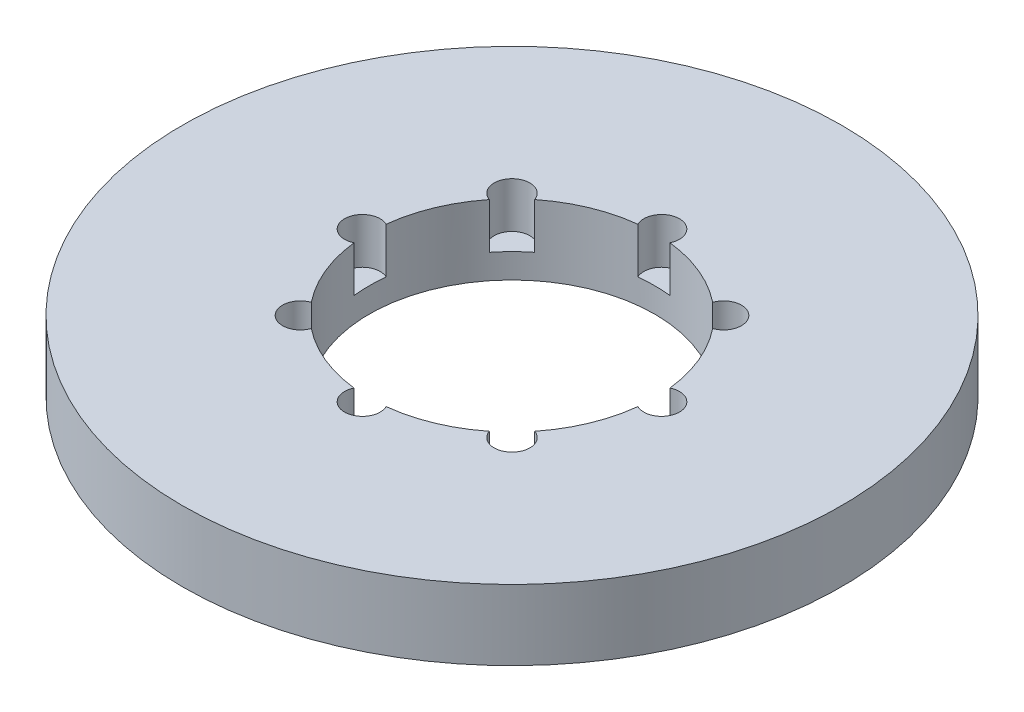
ISO-10303-21;
HEADER;
FILE_DESCRIPTION(('STEP AP214'),'2;1');
FILE_NAME('part.step','',(''),(''),'','','');
FILE_SCHEMA(('AUTOMOTIVE_DESIGN { 1 0 10303 214 1 1 1 1 }'));
ENDSEC;
DATA;
#1=APPLICATION_CONTEXT('core data for automotive mechanical design processes');
#2=APPLICATION_PROTOCOL_DEFINITION('international standard','automotive_design',2000,#1);
#3=PRODUCT_CONTEXT('',#1,'mechanical');
#4=PRODUCT('Part','Part','',(#3));
#5=PRODUCT_RELATED_PRODUCT_CATEGORY('part','',(#4));
#6=PRODUCT_DEFINITION_FORMATION('','',#4);
#7=PRODUCT_DEFINITION_CONTEXT('part definition',#1,'design');
#8=PRODUCT_DEFINITION('design','',#6,#7);
#9=PRODUCT_DEFINITION_SHAPE('','',#8);
#10=(LENGTH_UNIT() NAMED_UNIT(*) SI_UNIT(.MILLI.,.METRE.));
#11=(NAMED_UNIT(*) PLANE_ANGLE_UNIT() SI_UNIT($,.RADIAN.));
#12=(NAMED_UNIT(*) SI_UNIT($,.STERADIAN.) SOLID_ANGLE_UNIT());
#13=UNCERTAINTY_MEASURE_WITH_UNIT(LENGTH_MEASURE(1.E-05),#10,'distance_accuracy_value','');
#14=(GEOMETRIC_REPRESENTATION_CONTEXT(3) GLOBAL_UNCERTAINTY_ASSIGNED_CONTEXT((#13)) GLOBAL_UNIT_ASSIGNED_CONTEXT((#10,
#11,#12)) REPRESENTATION_CONTEXT('',''));
#15=CARTESIAN_POINT('',(0.,0.,0.));
#16=DIRECTION('',(0.,0.,1.));
#17=DIRECTION('',(1.,0.,0.));
#18=AXIS2_PLACEMENT_3D('',#15,#16,#17);
#19=CARTESIAN_POINT('',(0.,16.,0.));
#20=DIRECTION('',(0.,-1.,0.));
#21=DIRECTION('',(0.,0.,-1.));
#22=AXIS2_PLACEMENT_3D('',#19,#20,#21);
#23=CYLINDRICAL_SURFACE('',#22,75.);
#24=CARTESIAN_POINT('',(0.,16.,0.));
#25=DIRECTION('',(0.,1.,0.));
#26=DIRECTION('',(0.,0.,1.));
#27=AXIS2_PLACEMENT_3D('',#24,#25,#26);
#28=CIRCLE('',#27,75.);
#29=CARTESIAN_POINT('',(0.,16.,75.));
#30=VERTEX_POINT('',#29);
#31=EDGE_CURVE('E195',#30,#30,#28,.T.);
#32=ORIENTED_EDGE('',*,*,#31,.F.);
#33=EDGE_LOOP('',(#32));
#34=FACE_BOUND('',#33,.T.);
#35=CARTESIAN_POINT('',(0.,0.,0.));
#36=DIRECTION('',(0.,1.,0.));
#37=DIRECTION('',(0.,0.,1.));
#38=AXIS2_PLACEMENT_3D('',#35,#36,#37);
#39=CIRCLE('',#38,75.);
#40=CARTESIAN_POINT('',(0.,0.,75.));
#41=VERTEX_POINT('',#40);
#42=EDGE_CURVE('E179',#41,#41,#39,.T.);
#43=ORIENTED_EDGE('',*,*,#42,.T.);
#44=EDGE_LOOP('',(#43));
#45=FACE_BOUND('',#44,.T.);
#46=ADVANCED_FACE('F39',(#34,#45),#23,.T.);
#47=CARTESIAN_POINT('',(0.,16.,0.));
#48=DIRECTION('',(0.,1.,0.));
#49=DIRECTION('',(0.,0.,1.));
#50=AXIS2_PLACEMENT_3D('',#47,#48,#49);
#51=PLANE('',#50);
#52=CARTESIAN_POINT('',(1.18898524281873E-13,16.,34.053890811076));
#53=DIRECTION('',(0.,1.,0.));
#54=DIRECTION('',(1.,0.,0.));
#55=AXIS2_PLACEMENT_3D('',#52,#53,#54);
#56=CIRCLE('',#55,4.05931394049338);
#57=CARTESIAN_POINT('',(-3.65774458049449,16.,32.2935118032069));
#58=VERTEX_POINT('',#57);
#59=CARTESIAN_POINT('',(3.65774458049472,16.,32.2935118032069));
#60=VERTEX_POINT('',#59);
#61=EDGE_CURVE('E176',#58,#60,#56,.T.);
#62=ORIENTED_EDGE('',*,*,#61,.F.);
#63=CARTESIAN_POINT('',(0.,16.,0.));
#64=DIRECTION('',(0.,1.,0.));
#65=DIRECTION('',(0.,0.,1.));
#66=AXIS2_PLACEMENT_3D('',#63,#64,#65);
#67=CIRCLE('',#66,32.5);
#68=CARTESIAN_POINT('',(-20.2485451876593,16.,25.4213771810915));
#69=VERTEX_POINT('',#68);
#70=EDGE_CURVE('E166',#69,#58,#67,.T.);
#71=ORIENTED_EDGE('',*,*,#70,.F.);
#72=CARTESIAN_POINT('',(-24.0797371182981,16.,24.0797371182981));
#73=DIRECTION('',(0.,1.,0.));
#74=DIRECTION('',(0.707106781186549,0.,0.707106781186546));
#75=AXIS2_PLACEMENT_3D('',#72,#73,#74);
#76=CIRCLE('',#75,4.05931394049338);
#77=CARTESIAN_POINT('',(-25.4213771810914,16.,20.2485451876594));
#78=VERTEX_POINT('',#77);
#79=EDGE_CURVE('E147',#78,#69,#76,.T.);
#80=ORIENTED_EDGE('',*,*,#79,.F.);
#81=CARTESIAN_POINT('',(-32.2935118032069,16.,3.6577445804946));
#82=VERTEX_POINT('',#81);
#83=EDGE_CURVE('E180',#82,#78,#67,.T.);
#84=ORIENTED_EDGE('',*,*,#83,.F.);
#85=CARTESIAN_POINT('',(-34.053890811076,16.,0.));
#86=DIRECTION('',(0.,1.,0.));
#87=DIRECTION('',(0.,0.,1.));
#88=AXIS2_PLACEMENT_3D('',#85,#86,#87);
#89=CIRCLE('',#88,4.05931394049338);
#90=CARTESIAN_POINT('',(-32.2935118032069,16.,-3.6577445804946));
#91=VERTEX_POINT('',#90);
#92=EDGE_CURVE('E186',#91,#82,#89,.T.);
#93=ORIENTED_EDGE('',*,*,#92,.F.);
#94=CARTESIAN_POINT('',(-25.4213771810917,16.,-20.248545187659));
#95=VERTEX_POINT('',#94);
#96=EDGE_CURVE('E182',#95,#91,#67,.T.);
#97=ORIENTED_EDGE('',*,*,#96,.F.);
#98=CARTESIAN_POINT('',(-24.0797371182984,16.,-24.0797371182978));
#99=DIRECTION('',(0.,1.,0.));
#100=DIRECTION('',(-0.707106781186539,0.,0.707106781186556));
#101=AXIS2_PLACEMENT_3D('',#98,#99,#100);
#102=CIRCLE('',#101,4.05931394049338);
#103=CARTESIAN_POINT('',(-20.2485451876596,16.,-25.4213771810912));
#104=VERTEX_POINT('',#103);
#105=EDGE_CURVE('E446',#104,#95,#102,.T.);
#106=ORIENTED_EDGE('',*,*,#105,.F.);
#107=CARTESIAN_POINT('',(-3.65774458049494,16.,-32.2935118032068));
#108=VERTEX_POINT('',#107);
#109=EDGE_CURVE('E452',#108,#104,#67,.T.);
#110=ORIENTED_EDGE('',*,*,#109,.F.);
#111=CARTESIAN_POINT('',(-3.56695572845621E-13,16.,-34.053890811076));
#112=DIRECTION('',(0.,1.,0.));
#113=DIRECTION('',(-1.,0.,0.));
#114=AXIS2_PLACEMENT_3D('',#111,#112,#113);
#115=CIRCLE('',#114,4.05931394049338);
#116=CARTESIAN_POINT('',(3.65774458049427,16.,-32.2935118032069));
#117=VERTEX_POINT('',#116);
#118=EDGE_CURVE('E477',#117,#108,#115,.T.);
#119=ORIENTED_EDGE('',*,*,#118,.F.);
#120=CARTESIAN_POINT('',(20.2485451876591,16.,-25.4213771810917));
#121=VERTEX_POINT('',#120);
#122=EDGE_CURVE('E460',#121,#117,#67,.T.);
#123=ORIENTED_EDGE('',*,*,#122,.F.);
#124=CARTESIAN_POINT('',(24.0797371182979,16.,-24.0797371182983));
#125=DIRECTION('',(0.,1.,0.));
#126=DIRECTION('',(-0.707106781186554,0.,-0.707106781186541));
#127=AXIS2_PLACEMENT_3D('',#124,#125,#126);
#128=CIRCLE('',#127,4.05931394049338);
#129=CARTESIAN_POINT('',(25.4213771810913,16.,-20.2485451876595));
#130=VERTEX_POINT('',#129);
#131=EDGE_CURVE('E464',#130,#121,#128,.T.);
#132=ORIENTED_EDGE('',*,*,#131,.F.);
#133=CARTESIAN_POINT('',(32.2935118032069,16.,-3.6577445804946));
#134=VERTEX_POINT('',#133);
#135=EDGE_CURVE('E459',#134,#130,#67,.T.);
#136=ORIENTED_EDGE('',*,*,#135,.F.);
#137=CARTESIAN_POINT('',(34.053890811076,16.,0.));
#138=DIRECTION('',(0.,1.,0.));
#139=DIRECTION('',(0.,0.,-1.));
#140=AXIS2_PLACEMENT_3D('',#137,#138,#139);
#141=CIRCLE('',#140,4.05931394049338);
#142=CARTESIAN_POINT('',(32.2935118032069,16.,3.6577445804946));
#143=VERTEX_POINT('',#142);
#144=EDGE_CURVE('E469',#143,#134,#141,.T.);
#145=ORIENTED_EDGE('',*,*,#144,.F.);
#146=CARTESIAN_POINT('',(25.4213771810916,16.,20.2485451876592));
#147=VERTEX_POINT('',#146);
#148=EDGE_CURVE('E181',#147,#143,#67,.T.);
#149=ORIENTED_EDGE('',*,*,#148,.F.);
#150=CARTESIAN_POINT('',(24.0797371182982,16.,24.079737118298));
#151=DIRECTION('',(0.,1.,0.));
#152=DIRECTION('',(0.707106781186544,0.,-0.707106781186551));
#153=AXIS2_PLACEMENT_3D('',#150,#151,#152);
#154=CIRCLE('',#153,4.05931394049338);
#155=CARTESIAN_POINT('',(20.2485451876595,16.,25.4213771810914));
#156=VERTEX_POINT('',#155);
#157=EDGE_CURVE('E475',#156,#147,#154,.T.);
#158=ORIENTED_EDGE('',*,*,#157,.F.);
#159=EDGE_CURVE('E177',#60,#156,#67,.T.);
#160=ORIENTED_EDGE('',*,*,#159,.F.);
#161=EDGE_LOOP('',(#62,#71,#80,#84,#93,#97,#106,#110,#119,#123,#132,#136,#145,#149,#158,#160));
#162=FACE_BOUND('',#161,.T.);
#163=ORIENTED_EDGE('',*,*,#31,.T.);
#164=EDGE_LOOP('',(#163));
#165=FACE_BOUND('',#164,.T.);
#166=ADVANCED_FACE('F172',(#162,#165),#51,.T.);
#167=CARTESIAN_POINT('',(0.,0.,0.));
#168=DIRECTION('',(0.,1.,0.));
#169=DIRECTION('',(0.,0.,1.));
#170=AXIS2_PLACEMENT_3D('',#167,#168,#169);
#171=PLANE('',#170);
#172=CARTESIAN_POINT('',(0.,0.,0.));
#173=DIRECTION('',(0.,1.,0.));
#174=DIRECTION('',(0.,0.,1.));
#175=AXIS2_PLACEMENT_3D('',#172,#173,#174);
#176=CIRCLE('',#175,32.5);
#177=CARTESIAN_POINT('',(0.,0.,32.5));
#178=VERTEX_POINT('',#177);
#179=EDGE_CURVE('E187',#178,#178,#176,.T.);
#180=ORIENTED_EDGE('',*,*,#179,.T.);
#181=EDGE_LOOP('',(#180));
#182=FACE_BOUND('',#181,.T.);
#183=ORIENTED_EDGE('',*,*,#42,.F.);
#184=EDGE_LOOP('',(#183));
#185=FACE_BOUND('',#184,.T.);
#186=ADVANCED_FACE('F270',(#182,#185),#171,.F.);
#187=CARTESIAN_POINT('',(0.,16.,0.));
#188=DIRECTION('',(0.,-1.,0.));
#189=DIRECTION('',(0.,0.,-1.));
#190=AXIS2_PLACEMENT_3D('',#187,#188,#189);
#191=CYLINDRICAL_SURFACE('',#190,32.5);
#192=DIRECTION('',(0.,1.,0.));
#193=VECTOR('',#192,1.);
#194=CARTESIAN_POINT('',(-3.65774458049449,10.7992135579897,32.2935118032069));
#195=LINE('',#194,#193);
#196=CARTESIAN_POINT('',(-3.65774458049449,5.59842711597934,32.2935118032069));
#197=VERTEX_POINT('',#196);
#198=EDGE_CURVE('E11',#197,#58,#195,.T.);
#199=ORIENTED_EDGE('',*,*,#198,.F.);
#200=CARTESIAN_POINT('',(0.,5.59842711597934,0.));
#201=DIRECTION('',(0.,1.,0.));
#202=DIRECTION('',(0.,0.,1.));
#203=AXIS2_PLACEMENT_3D('',#200,#201,#202);
#204=CIRCLE('',#203,32.5);
#205=CARTESIAN_POINT('',(3.65774458049472,5.59842711597934,32.2935118032069));
#206=VERTEX_POINT('',#205);
#207=EDGE_CURVE('E250',#197,#206,#204,.T.);
#208=ORIENTED_EDGE('',*,*,#207,.T.);
#209=DIRECTION('',(0.,1.,0.));
#210=VECTOR('',#209,1.);
#211=CARTESIAN_POINT('',(3.65774458049472,10.7992135579897,32.2935118032069));
#212=LINE('',#211,#210);
#213=EDGE_CURVE('E46',#60,#206,#212,.F.);
#214=ORIENTED_EDGE('',*,*,#213,.F.);
#215=ORIENTED_EDGE('',*,*,#159,.T.);
#216=DIRECTION('',(0.,1.,0.));
#217=VECTOR('',#216,1.);
#218=CARTESIAN_POINT('',(20.2485451876595,10.7992135579897,25.4213771810914));
#219=LINE('',#218,#217);
#220=CARTESIAN_POINT('',(20.2485451876595,5.59842711597934,25.4213771810914));
#221=VERTEX_POINT('',#220);
#222=EDGE_CURVE('E244',#221,#156,#219,.T.);
#223=ORIENTED_EDGE('',*,*,#222,.F.);
#224=CARTESIAN_POINT('',(0.,5.59842711597934,0.));
#225=DIRECTION('',(0.,1.,0.));
#226=DIRECTION('',(0.,0.,1.));
#227=AXIS2_PLACEMENT_3D('',#224,#225,#226);
#228=CIRCLE('',#227,32.5);
#229=CARTESIAN_POINT('',(25.4213771810916,5.59842711597934,20.2485451876592));
#230=VERTEX_POINT('',#229);
#231=EDGE_CURVE('E238',#221,#230,#228,.T.);
#232=ORIENTED_EDGE('',*,*,#231,.T.);
#233=DIRECTION('',(0.,1.,0.));
#234=VECTOR('',#233,1.);
#235=CARTESIAN_POINT('',(25.4213771810916,10.7992135579897,20.2485451876592));
#236=LINE('',#235,#234);
#237=EDGE_CURVE('E242',#147,#230,#236,.F.);
#238=ORIENTED_EDGE('',*,*,#237,.F.);
#239=ORIENTED_EDGE('',*,*,#148,.T.);
#240=DIRECTION('',(0.,1.,0.));
#241=VECTOR('',#240,1.);
#242=CARTESIAN_POINT('',(32.2935118032069,10.7992135579897,3.6577445804946));
#243=LINE('',#242,#241);
#244=CARTESIAN_POINT('',(32.2935118032069,5.59842711597934,3.6577445804946));
#245=VERTEX_POINT('',#244);
#246=EDGE_CURVE('E236',#245,#143,#243,.T.);
#247=ORIENTED_EDGE('',*,*,#246,.F.);
#248=CARTESIAN_POINT('',(0.,5.59842711597934,0.));
#249=DIRECTION('',(0.,1.,0.));
#250=DIRECTION('',(0.,0.,1.));
#251=AXIS2_PLACEMENT_3D('',#248,#249,#250);
#252=CIRCLE('',#251,32.5);
#253=CARTESIAN_POINT('',(32.2935118032069,5.59842711597934,-3.6577445804946));
#254=VERTEX_POINT('',#253);
#255=EDGE_CURVE('E235',#245,#254,#252,.T.);
#256=ORIENTED_EDGE('',*,*,#255,.T.);
#257=DIRECTION('',(0.,1.,0.));
#258=VECTOR('',#257,1.);
#259=CARTESIAN_POINT('',(32.2935118032069,10.7992135579897,-3.6577445804946));
#260=LINE('',#259,#258);
#261=EDGE_CURVE('E234',#134,#254,#260,.F.);
#262=ORIENTED_EDGE('',*,*,#261,.F.);
#263=ORIENTED_EDGE('',*,*,#135,.T.);
#264=DIRECTION('',(0.,1.,0.));
#265=VECTOR('',#264,1.);
#266=CARTESIAN_POINT('',(25.4213771810913,10.7992135579897,-20.2485451876595));
#267=LINE('',#266,#265);
#268=CARTESIAN_POINT('',(25.4213771810913,5.59842711597934,-20.2485451876595));
#269=VERTEX_POINT('',#268);
#270=EDGE_CURVE('E229',#269,#130,#267,.T.);
#271=ORIENTED_EDGE('',*,*,#270,.F.);
#272=CARTESIAN_POINT('',(0.,5.59842711597934,0.));
#273=DIRECTION('',(0.,1.,0.));
#274=DIRECTION('',(0.,0.,1.));
#275=AXIS2_PLACEMENT_3D('',#272,#273,#274);
#276=CIRCLE('',#275,32.5);
#277=CARTESIAN_POINT('',(20.2485451876591,5.59842711597934,-25.4213771810917));
#278=VERTEX_POINT('',#277);
#279=EDGE_CURVE('E221',#269,#278,#276,.T.);
#280=ORIENTED_EDGE('',*,*,#279,.T.);
#281=DIRECTION('',(0.,1.,0.));
#282=VECTOR('',#281,1.);
#283=CARTESIAN_POINT('',(20.2485451876591,10.7992135579897,-25.4213771810916));
#284=LINE('',#283,#282);
#285=EDGE_CURVE('E230',#121,#278,#284,.F.);
#286=ORIENTED_EDGE('',*,*,#285,.F.);
#287=ORIENTED_EDGE('',*,*,#122,.T.);
#288=DIRECTION('',(0.,1.,0.));
#289=VECTOR('',#288,1.);
#290=CARTESIAN_POINT('',(3.65774458049426,10.7992135579897,-32.2935118032069));
#291=LINE('',#290,#289);
#292=CARTESIAN_POINT('',(3.65774458049427,5.59842711597934,-32.2935118032069));
#293=VERTEX_POINT('',#292);
#294=EDGE_CURVE('E225',#293,#117,#291,.T.);
#295=ORIENTED_EDGE('',*,*,#294,.F.);
#296=CARTESIAN_POINT('',(0.,5.59842711597934,0.));
#297=DIRECTION('',(0.,1.,0.));
#298=DIRECTION('',(0.,0.,1.));
#299=AXIS2_PLACEMENT_3D('',#296,#297,#298);
#300=CIRCLE('',#299,32.5);
#301=CARTESIAN_POINT('',(-3.65774458049494,5.59842711597934,-32.2935118032068));
#302=VERTEX_POINT('',#301);
#303=EDGE_CURVE('E216',#293,#302,#300,.T.);
#304=ORIENTED_EDGE('',*,*,#303,.T.);
#305=DIRECTION('',(0.,1.,0.));
#306=VECTOR('',#305,1.);
#307=CARTESIAN_POINT('',(-3.65774458049494,10.7992135579897,-32.2935118032068));
#308=LINE('',#307,#306);
#309=EDGE_CURVE('E218',#108,#302,#308,.F.);
#310=ORIENTED_EDGE('',*,*,#309,.F.);
#311=ORIENTED_EDGE('',*,*,#109,.T.);
#312=DIRECTION('',(0.,1.,0.));
#313=VECTOR('',#312,1.);
#314=CARTESIAN_POINT('',(-20.2485451876596,10.7992135579897,-25.4213771810912));
#315=LINE('',#314,#313);
#316=CARTESIAN_POINT('',(-20.2485451876596,5.59842711597934,-25.4213771810912));
#317=VERTEX_POINT('',#316);
#318=EDGE_CURVE('E212',#317,#104,#315,.T.);
#319=ORIENTED_EDGE('',*,*,#318,.F.);
#320=CARTESIAN_POINT('',(0.,5.59842711597934,0.));
#321=DIRECTION('',(0.,1.,0.));
#322=DIRECTION('',(0.,0.,1.));
#323=AXIS2_PLACEMENT_3D('',#320,#321,#322);
#324=CIRCLE('',#323,32.5);
#325=CARTESIAN_POINT('',(-25.4213771810917,5.59842711597934,-20.248545187659));
#326=VERTEX_POINT('',#325);
#327=EDGE_CURVE('E208',#317,#326,#324,.T.);
#328=ORIENTED_EDGE('',*,*,#327,.T.);
#329=DIRECTION('',(0.,1.,0.));
#330=VECTOR('',#329,1.);
#331=CARTESIAN_POINT('',(-25.4213771810917,10.7992135579897,-20.248545187659));
#332=LINE('',#331,#330);
#333=EDGE_CURVE('E211',#95,#326,#332,.F.);
#334=ORIENTED_EDGE('',*,*,#333,.F.);
#335=ORIENTED_EDGE('',*,*,#96,.T.);
#336=DIRECTION('',(0.,1.,0.));
#337=VECTOR('',#336,1.);
#338=CARTESIAN_POINT('',(-32.2935118032069,10.7992135579897,-3.6577445804946));
#339=LINE('',#338,#337);
#340=CARTESIAN_POINT('',(-32.2935118032069,5.59842711597934,-3.6577445804946));
#341=VERTEX_POINT('',#340);
#342=EDGE_CURVE('E201',#341,#91,#339,.T.);
#343=ORIENTED_EDGE('',*,*,#342,.F.);
#344=CARTESIAN_POINT('',(0.,5.59842711597934,0.));
#345=DIRECTION('',(0.,1.,0.));
#346=DIRECTION('',(0.,0.,1.));
#347=AXIS2_PLACEMENT_3D('',#344,#345,#346);
#348=CIRCLE('',#347,32.5);
#349=CARTESIAN_POINT('',(-32.2935118032069,5.59842711597934,3.6577445804946));
#350=VERTEX_POINT('',#349);
#351=EDGE_CURVE('E194',#341,#350,#348,.T.);
#352=ORIENTED_EDGE('',*,*,#351,.T.);
#353=DIRECTION('',(0.,1.,0.));
#354=VECTOR('',#353,1.);
#355=CARTESIAN_POINT('',(-32.2935118032069,10.7992135579897,3.6577445804946));
#356=LINE('',#355,#354);
#357=EDGE_CURVE('E199',#82,#350,#356,.F.);
#358=ORIENTED_EDGE('',*,*,#357,.F.);
#359=ORIENTED_EDGE('',*,*,#83,.T.);
#360=DIRECTION('',(0.,1.,0.));
#361=VECTOR('',#360,1.);
#362=CARTESIAN_POINT('',(-25.4213771810914,10.7992135579897,20.2485451876594));
#363=LINE('',#362,#361);
#364=CARTESIAN_POINT('',(-25.4213771810914,5.59842711597934,20.2485451876594));
#365=VERTEX_POINT('',#364);
#366=EDGE_CURVE('E160',#365,#78,#363,.T.);
#367=ORIENTED_EDGE('',*,*,#366,.F.);
#368=CARTESIAN_POINT('',(0.,5.59842711597934,0.));
#369=DIRECTION('',(0.,1.,0.));
#370=DIRECTION('',(0.,0.,1.));
#371=AXIS2_PLACEMENT_3D('',#368,#369,#370);
#372=CIRCLE('',#371,32.5);
#373=CARTESIAN_POINT('',(-20.2485451876593,5.59842711597934,25.4213771810915));
#374=VERTEX_POINT('',#373);
#375=EDGE_CURVE('E168',#365,#374,#372,.T.);
#376=ORIENTED_EDGE('',*,*,#375,.T.);
#377=DIRECTION('',(0.,1.,0.));
#378=VECTOR('',#377,1.);
#379=CARTESIAN_POINT('',(-20.2485451876593,10.7992135579897,25.4213771810915));
#380=LINE('',#379,#378);
#381=EDGE_CURVE('E152',#69,#374,#380,.F.);
#382=ORIENTED_EDGE('',*,*,#381,.F.);
#383=ORIENTED_EDGE('',*,*,#70,.T.);
#384=EDGE_LOOP('',(#199,#208,#214,#215,#223,#232,#238,#239,#247,#256,#262,#263,#271,#280,#286,
#287,#295,#304,#310,#311,#319,#328,#334,#335,#343,#352,#358,#359,#367,#376,#382,#383));
#385=FACE_BOUND('',#384,.T.);
#386=ORIENTED_EDGE('',*,*,#179,.F.);
#387=EDGE_LOOP('',(#386));
#388=FACE_BOUND('',#387,.T.);
#389=ADVANCED_FACE('F170',(#385,#388),#191,.F.);
#390=CARTESIAN_POINT('',(-34.053890811076,5.59842711597934,0.));
#391=DIRECTION('',(0.,1.,0.));
#392=DIRECTION('',(0.,0.,1.));
#393=AXIS2_PLACEMENT_3D('',#390,#391,#392);
#394=CYLINDRICAL_SURFACE('',#393,4.05931394049338);
#395=ORIENTED_EDGE('',*,*,#342,.T.);
#396=ORIENTED_EDGE('',*,*,#92,.T.);
#397=ORIENTED_EDGE('',*,*,#357,.T.);
#398=CARTESIAN_POINT('',(-34.053890811076,5.59842711597934,0.));
#399=DIRECTION('',(0.,1.,0.));
#400=DIRECTION('',(0.,0.,1.));
#401=AXIS2_PLACEMENT_3D('',#398,#399,#400);
#402=CIRCLE('',#401,4.05931394049338);
#403=EDGE_CURVE('E191',#341,#350,#402,.T.);
#404=ORIENTED_EDGE('',*,*,#403,.F.);
#405=EDGE_LOOP('',(#395,#396,#397,#404));
#406=FACE_BOUND('',#405,.T.);
#407=ADVANCED_FACE('F279',(#406),#394,.F.);
#408=CARTESIAN_POINT('',(-34.053890811076,5.59842711597934,0.));
#409=DIRECTION('',(0.,1.,0.));
#410=DIRECTION('',(0.,0.,1.));
#411=AXIS2_PLACEMENT_3D('',#408,#409,#410);
#412=PLANE('',#411);
#413=ORIENTED_EDGE('',*,*,#403,.T.);
#414=ORIENTED_EDGE('',*,*,#351,.F.);
#415=EDGE_LOOP('',(#413,#414));
#416=FACE_BOUND('',#415,.T.);
#417=ADVANCED_FACE('F285',(#416),#412,.T.);
#418=CARTESIAN_POINT('',(-24.0797371182981,5.59842711597934,24.0797371182981));
#419=DIRECTION('',(0.,1.,0.));
#420=DIRECTION('',(0.,0.,1.));
#421=AXIS2_PLACEMENT_3D('',#418,#419,#420);
#422=CYLINDRICAL_SURFACE('',#421,4.05931394049338);
#423=ORIENTED_EDGE('',*,*,#366,.T.);
#424=ORIENTED_EDGE('',*,*,#79,.T.);
#425=ORIENTED_EDGE('',*,*,#381,.T.);
#426=CARTESIAN_POINT('',(-24.0797371182981,5.59842711597934,24.0797371182981));
#427=DIRECTION('',(0.,1.,0.));
#428=DIRECTION('',(0.707106781186549,0.,0.707106781186546));
#429=AXIS2_PLACEMENT_3D('',#426,#427,#428);
#430=CIRCLE('',#429,4.05931394049338);
#431=EDGE_CURVE('E165',#365,#374,#430,.T.);
#432=ORIENTED_EDGE('',*,*,#431,.F.);
#433=EDGE_LOOP('',(#423,#424,#425,#432));
#434=FACE_BOUND('',#433,.T.);
#435=ADVANCED_FACE('F155',(#434),#422,.F.);
#436=CARTESIAN_POINT('',(-24.0797371182981,5.59842711597934,24.0797371182981));
#437=DIRECTION('',(0.,1.,0.));
#438=DIRECTION('',(0.707106781186549,0.,0.707106781186546));
#439=AXIS2_PLACEMENT_3D('',#436,#437,#438);
#440=PLANE('',#439);
#441=ORIENTED_EDGE('',*,*,#431,.T.);
#442=ORIENTED_EDGE('',*,*,#375,.F.);
#443=EDGE_LOOP('',(#441,#442));
#444=FACE_BOUND('',#443,.T.);
#445=ADVANCED_FACE('F288',(#444),#440,.T.);
#446=CARTESIAN_POINT('',(-24.0797371182984,5.59842711597934,-24.0797371182978));
#447=DIRECTION('',(0.,1.,0.));
#448=DIRECTION('',(0.,0.,1.));
#449=AXIS2_PLACEMENT_3D('',#446,#447,#448);
#450=CYLINDRICAL_SURFACE('',#449,4.05931394049338);
#451=ORIENTED_EDGE('',*,*,#318,.T.);
#452=ORIENTED_EDGE('',*,*,#105,.T.);
#453=ORIENTED_EDGE('',*,*,#333,.T.);
#454=CARTESIAN_POINT('',(-24.0797371182984,5.59842711597934,-24.0797371182978));
#455=DIRECTION('',(0.,1.,0.));
#456=DIRECTION('',(-0.707106781186539,0.,0.707106781186556));
#457=AXIS2_PLACEMENT_3D('',#454,#455,#456);
#458=CIRCLE('',#457,4.05931394049338);
#459=EDGE_CURVE('E447',#317,#326,#458,.T.);
#460=ORIENTED_EDGE('',*,*,#459,.F.);
#461=EDGE_LOOP('',(#451,#452,#453,#460));
#462=FACE_BOUND('',#461,.T.);
#463=ADVANCED_FACE('F295',(#462),#450,.F.);
#464=CARTESIAN_POINT('',(-24.0797371182984,5.59842711597934,-24.0797371182978));
#465=DIRECTION('',(0.,1.,0.));
#466=DIRECTION('',(-0.707106781186539,0.,0.707106781186556));
#467=AXIS2_PLACEMENT_3D('',#464,#465,#466);
#468=PLANE('',#467);
#469=ORIENTED_EDGE('',*,*,#459,.T.);
#470=ORIENTED_EDGE('',*,*,#327,.F.);
#471=EDGE_LOOP('',(#469,#470));
#472=FACE_BOUND('',#471,.T.);
#473=ADVANCED_FACE('F375',(#472),#468,.T.);
#474=CARTESIAN_POINT('',(-3.56695572845621E-13,5.59842711597934,-34.053890811076));
#475=DIRECTION('',(0.,1.,0.));
#476=DIRECTION('',(0.,0.,1.));
#477=AXIS2_PLACEMENT_3D('',#474,#475,#476);
#478=CYLINDRICAL_SURFACE('',#477,4.05931394049338);
#479=ORIENTED_EDGE('',*,*,#294,.T.);
#480=ORIENTED_EDGE('',*,*,#118,.T.);
#481=ORIENTED_EDGE('',*,*,#309,.T.);
#482=CARTESIAN_POINT('',(-3.56695572845621E-13,5.59842711597934,-34.053890811076));
#483=DIRECTION('',(0.,1.,0.));
#484=DIRECTION('',(-1.,0.,0.));
#485=AXIS2_PLACEMENT_3D('',#482,#483,#484);
#486=CIRCLE('',#485,4.05931394049338);
#487=EDGE_CURVE('E467',#293,#302,#486,.T.);
#488=ORIENTED_EDGE('',*,*,#487,.F.);
#489=EDGE_LOOP('',(#479,#480,#481,#488));
#490=FACE_BOUND('',#489,.T.);
#491=ADVANCED_FACE('F361',(#490),#478,.F.);
#492=CARTESIAN_POINT('',(-3.56695572845621E-13,5.59842711597934,-34.053890811076));
#493=DIRECTION('',(0.,1.,0.));
#494=DIRECTION('',(-1.,0.,0.));
#495=AXIS2_PLACEMENT_3D('',#492,#493,#494);
#496=PLANE('',#495);
#497=ORIENTED_EDGE('',*,*,#487,.T.);
#498=ORIENTED_EDGE('',*,*,#303,.F.);
#499=EDGE_LOOP('',(#497,#498));
#500=FACE_BOUND('',#499,.T.);
#501=ADVANCED_FACE('F297',(#500),#496,.T.);
#502=CARTESIAN_POINT('',(24.0797371182979,5.59842711597934,-24.0797371182983));
#503=DIRECTION('',(0.,1.,0.));
#504=DIRECTION('',(0.,0.,1.));
#505=AXIS2_PLACEMENT_3D('',#502,#503,#504);
#506=CYLINDRICAL_SURFACE('',#505,4.05931394049338);
#507=ORIENTED_EDGE('',*,*,#270,.T.);
#508=ORIENTED_EDGE('',*,*,#131,.T.);
#509=ORIENTED_EDGE('',*,*,#285,.T.);
#510=CARTESIAN_POINT('',(24.0797371182979,5.59842711597934,-24.0797371182983));
#511=DIRECTION('',(0.,1.,0.));
#512=DIRECTION('',(-0.707106781186554,0.,-0.707106781186541));
#513=AXIS2_PLACEMENT_3D('',#510,#511,#512);
#514=CIRCLE('',#513,4.05931394049338);
#515=EDGE_CURVE('E470',#269,#278,#514,.T.);
#516=ORIENTED_EDGE('',*,*,#515,.F.);
#517=EDGE_LOOP('',(#507,#508,#509,#516));
#518=FACE_BOUND('',#517,.T.);
#519=ADVANCED_FACE('F294',(#518),#506,.F.);
#520=CARTESIAN_POINT('',(24.0797371182979,5.59842711597934,-24.0797371182983));
#521=DIRECTION('',(0.,1.,0.));
#522=DIRECTION('',(-0.707106781186554,0.,-0.707106781186541));
#523=AXIS2_PLACEMENT_3D('',#520,#521,#522);
#524=PLANE('',#523);
#525=ORIENTED_EDGE('',*,*,#515,.T.);
#526=ORIENTED_EDGE('',*,*,#279,.F.);
#527=EDGE_LOOP('',(#525,#526));
#528=FACE_BOUND('',#527,.T.);
#529=ADVANCED_FACE('F300',(#528),#524,.T.);
#530=CARTESIAN_POINT('',(34.053890811076,5.59842711597934,0.));
#531=DIRECTION('',(0.,1.,0.));
#532=DIRECTION('',(0.,0.,1.));
#533=AXIS2_PLACEMENT_3D('',#530,#531,#532);
#534=CYLINDRICAL_SURFACE('',#533,4.05931394049338);
#535=ORIENTED_EDGE('',*,*,#246,.T.);
#536=ORIENTED_EDGE('',*,*,#144,.T.);
#537=ORIENTED_EDGE('',*,*,#261,.T.);
#538=CARTESIAN_POINT('',(34.053890811076,5.59842711597934,0.));
#539=DIRECTION('',(0.,1.,0.));
#540=DIRECTION('',(0.,0.,-1.));
#541=AXIS2_PLACEMENT_3D('',#538,#539,#540);
#542=CIRCLE('',#541,4.05931394049338);
#543=EDGE_CURVE('E472',#245,#254,#542,.T.);
#544=ORIENTED_EDGE('',*,*,#543,.F.);
#545=EDGE_LOOP('',(#535,#536,#537,#544));
#546=FACE_BOUND('',#545,.T.);
#547=ADVANCED_FACE('F305',(#546),#534,.F.);
#548=CARTESIAN_POINT('',(34.053890811076,5.59842711597934,0.));
#549=DIRECTION('',(0.,1.,0.));
#550=DIRECTION('',(0.,0.,-1.));
#551=AXIS2_PLACEMENT_3D('',#548,#549,#550);
#552=PLANE('',#551);
#553=ORIENTED_EDGE('',*,*,#543,.T.);
#554=ORIENTED_EDGE('',*,*,#255,.F.);
#555=EDGE_LOOP('',(#553,#554));
#556=FACE_BOUND('',#555,.T.);
#557=ADVANCED_FACE('F308',(#556),#552,.T.);
#558=CARTESIAN_POINT('',(24.0797371182982,5.59842711597934,24.079737118298));
#559=DIRECTION('',(0.,1.,0.));
#560=DIRECTION('',(0.,0.,1.));
#561=AXIS2_PLACEMENT_3D('',#558,#559,#560);
#562=CYLINDRICAL_SURFACE('',#561,4.05931394049338);
#563=ORIENTED_EDGE('',*,*,#222,.T.);
#564=ORIENTED_EDGE('',*,*,#157,.T.);
#565=ORIENTED_EDGE('',*,*,#237,.T.);
#566=CARTESIAN_POINT('',(24.0797371182982,5.59842711597934,24.079737118298));
#567=DIRECTION('',(0.,1.,0.));
#568=DIRECTION('',(0.707106781186544,0.,-0.707106781186551));
#569=AXIS2_PLACEMENT_3D('',#566,#567,#568);
#570=CIRCLE('',#569,4.05931394049338);
#571=EDGE_CURVE('E56',#221,#230,#570,.T.);
#572=ORIENTED_EDGE('',*,*,#571,.F.);
#573=EDGE_LOOP('',(#563,#564,#565,#572));
#574=FACE_BOUND('',#573,.T.);
#575=ADVANCED_FACE('F309',(#574),#562,.F.);
#576=CARTESIAN_POINT('',(24.0797371182982,5.59842711597934,24.079737118298));
#577=DIRECTION('',(0.,1.,0.));
#578=DIRECTION('',(0.707106781186544,0.,-0.707106781186551));
#579=AXIS2_PLACEMENT_3D('',#576,#577,#578);
#580=PLANE('',#579);
#581=ORIENTED_EDGE('',*,*,#571,.T.);
#582=ORIENTED_EDGE('',*,*,#231,.F.);
#583=EDGE_LOOP('',(#581,#582));
#584=FACE_BOUND('',#583,.T.);
#585=ADVANCED_FACE('F256',(#584),#580,.T.);
#586=CARTESIAN_POINT('',(1.18898524281873E-13,5.59842711597934,34.053890811076));
#587=DIRECTION('',(0.,1.,0.));
#588=DIRECTION('',(0.,0.,1.));
#589=AXIS2_PLACEMENT_3D('',#586,#587,#588);
#590=CYLINDRICAL_SURFACE('',#589,4.05931394049338);
#591=ORIENTED_EDGE('',*,*,#198,.T.);
#592=ORIENTED_EDGE('',*,*,#61,.T.);
#593=ORIENTED_EDGE('',*,*,#213,.T.);
#594=CARTESIAN_POINT('',(1.18898524281873E-13,5.59842711597934,34.053890811076));
#595=DIRECTION('',(0.,1.,0.));
#596=DIRECTION('',(1.,0.,0.));
#597=AXIS2_PLACEMENT_3D('',#594,#595,#596);
#598=CIRCLE('',#597,4.05931394049338);
#599=EDGE_CURVE('E55',#197,#206,#598,.T.);
#600=ORIENTED_EDGE('',*,*,#599,.F.);
#601=EDGE_LOOP('',(#591,#592,#593,#600));
#602=FACE_BOUND('',#601,.T.);
#603=ADVANCED_FACE('F253',(#602),#590,.F.);
#604=CARTESIAN_POINT('',(1.18898524281873E-13,5.59842711597934,34.053890811076));
#605=DIRECTION('',(0.,1.,0.));
#606=DIRECTION('',(1.,0.,0.));
#607=AXIS2_PLACEMENT_3D('',#604,#605,#606);
#608=PLANE('',#607);
#609=ORIENTED_EDGE('',*,*,#599,.T.);
#610=ORIENTED_EDGE('',*,*,#207,.F.);
#611=EDGE_LOOP('',(#609,#610));
#612=FACE_BOUND('',#611,.T.);
#613=ADVANCED_FACE('F252',(#612),#608,.T.);
#614=CLOSED_SHELL('',(#46,#166,#186,#389,#407,#417,#435,#445,#463,#473,#491,#501,#519,#529,#547,
#557,#575,#585,#603,#613));
#615=MANIFOLD_SOLID_BREP('B2',#614);
#616=ADVANCED_BREP_SHAPE_REPRESENTATION('',(#18,#615),#14);
#617=SHAPE_DEFINITION_REPRESENTATION(#9,#616);
ENDSEC;
END-ISO-10303-21;
